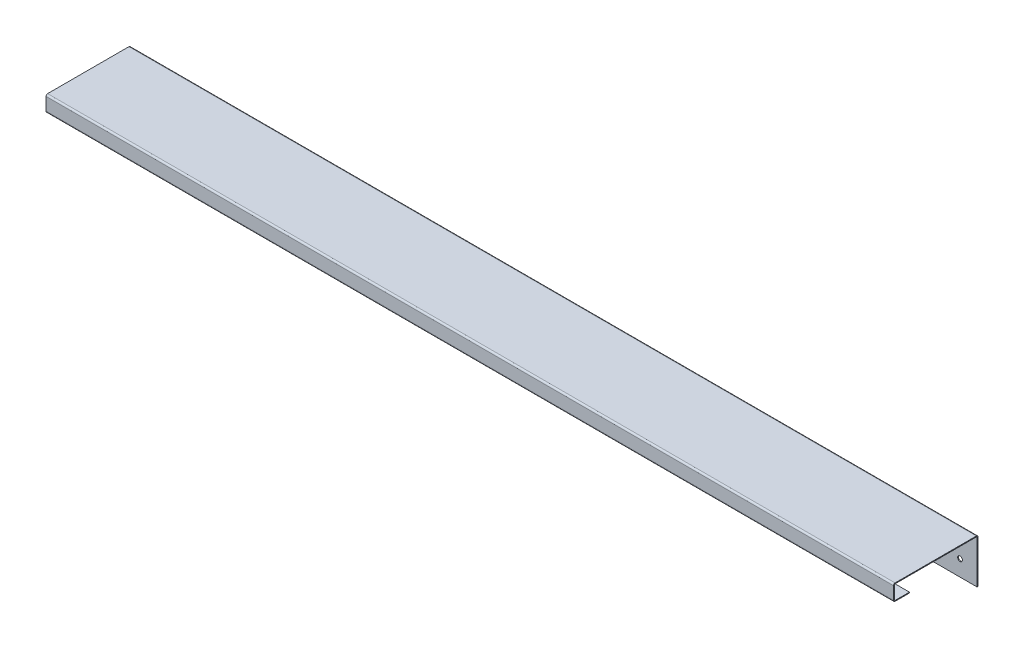
ISO-10303-21;
HEADER;
FILE_DESCRIPTION(('STEP AP214'),'2;1');
FILE_NAME('part.step','',(''),(''),'','','');
FILE_SCHEMA(('AUTOMOTIVE_DESIGN { 1 0 10303 214 1 1 1 1 }'));
ENDSEC;
DATA;
#1=APPLICATION_CONTEXT('core data for automotive mechanical design processes');
#2=APPLICATION_PROTOCOL_DEFINITION('international standard','automotive_design',2000,#1);
#3=PRODUCT_CONTEXT('',#1,'mechanical');
#4=PRODUCT('Part','Part','',(#3));
#5=PRODUCT_RELATED_PRODUCT_CATEGORY('part','',(#4));
#6=PRODUCT_DEFINITION_FORMATION('','',#4);
#7=PRODUCT_DEFINITION_CONTEXT('part definition',#1,'design');
#8=PRODUCT_DEFINITION('design','',#6,#7);
#9=PRODUCT_DEFINITION_SHAPE('','',#8);
#10=(LENGTH_UNIT() NAMED_UNIT(*) SI_UNIT(.MILLI.,.METRE.));
#11=(NAMED_UNIT(*) PLANE_ANGLE_UNIT() SI_UNIT($,.RADIAN.));
#12=(NAMED_UNIT(*) SI_UNIT($,.STERADIAN.) SOLID_ANGLE_UNIT());
#13=UNCERTAINTY_MEASURE_WITH_UNIT(LENGTH_MEASURE(1.E-05),#10,'distance_accuracy_value','');
#14=(GEOMETRIC_REPRESENTATION_CONTEXT(3) GLOBAL_UNCERTAINTY_ASSIGNED_CONTEXT((#13)) GLOBAL_UNIT_ASSIGNED_CONTEXT((#10,
#11,#12)) REPRESENTATION_CONTEXT('',''));
#15=CARTESIAN_POINT('',(0.,0.,0.));
#16=DIRECTION('',(0.,0.,1.));
#17=DIRECTION('',(1.,0.,0.));
#18=AXIS2_PLACEMENT_3D('',#15,#16,#17);
#19=CARTESIAN_POINT('',(1063.,27.7674141676382,-103.));
#20=DIRECTION('',(1.,0.,0.));
#21=DIRECTION('',(0.,0.,-1.));
#22=AXIS2_PLACEMENT_3D('',#19,#20,#21);
#23=PLANE('',#22);
#24=DIRECTION('',(0.,1.,0.));
#25=VECTOR('',#24,1.);
#26=CARTESIAN_POINT('',(1063.,27.7674141676382,-103.));
#27=LINE('',#26,#25);
#28=CARTESIAN_POINT('',(1063.,27.7674141676382,-103.));
#29=VERTEX_POINT('',#28);
#30=CARTESIAN_POINT('',(1063.,28.7674141676382,-103.));
#31=VERTEX_POINT('',#30);
#32=EDGE_CURVE('E11',#29,#31,#27,.T.);
#33=ORIENTED_EDGE('',*,*,#32,.F.);
#34=CARTESIAN_POINT('',(1063.,26.7674141676382,-103.));
#35=DIRECTION('',(-1.,0.,0.));
#36=DIRECTION('',(0.,0.,1.));
#37=AXIS2_PLACEMENT_3D('',#34,#35,#36);
#38=CIRCLE('',#37,1.);
#39=CARTESIAN_POINT('',(1063.,26.7674141676382,-104.));
#40=VERTEX_POINT('',#39);
#41=EDGE_CURVE('E385',#40,#29,#38,.F.);
#42=ORIENTED_EDGE('',*,*,#41,.F.);
#43=DIRECTION('',(0.,0.,1.));
#44=VECTOR('',#43,1.);
#45=CARTESIAN_POINT('',(1063.,26.7674141676382,-105.));
#46=LINE('',#45,#44);
#47=CARTESIAN_POINT('',(1063.,26.7674141676382,-105.));
#48=VERTEX_POINT('',#47);
#49=EDGE_CURVE('E50',#48,#40,#46,.T.);
#50=ORIENTED_EDGE('',*,*,#49,.F.);
#51=CARTESIAN_POINT('',(1063.,26.7674141676382,-103.));
#52=DIRECTION('',(1.,0.,0.));
#53=DIRECTION('',(0.,0.,-1.));
#54=AXIS2_PLACEMENT_3D('',#51,#52,#53);
#55=CIRCLE('',#54,2.);
#56=EDGE_CURVE('E401',#48,#31,#55,.T.);
#57=ORIENTED_EDGE('',*,*,#56,.T.);
#58=EDGE_LOOP('',(#33,#42,#50,#57));
#59=FACE_BOUND('',#58,.T.);
#60=ADVANCED_FACE('F40',(#59),#23,.T.);
#61=CARTESIAN_POINT('',(1063.,26.7674141676382,-105.));
#62=DIRECTION('',(1.,0.,0.));
#63=DIRECTION('',(0.,0.,-1.));
#64=AXIS2_PLACEMENT_3D('',#61,#62,#63);
#65=PLANE('',#64);
#66=DIRECTION('',(0.,0.,1.));
#67=VECTOR('',#66,1.);
#68=CARTESIAN_POINT('',(1063.,27.7674141676382,-104.));
#69=LINE('',#68,#67);
#70=CARTESIAN_POINT('',(1063.,27.7674141676382,-1.));
#71=VERTEX_POINT('',#70);
#72=EDGE_CURVE('E381',#29,#71,#69,.T.);
#73=ORIENTED_EDGE('',*,*,#72,.F.);
#74=ORIENTED_EDGE('',*,*,#32,.T.);
#75=DIRECTION('',(0.,0.,1.));
#76=VECTOR('',#75,1.);
#77=CARTESIAN_POINT('',(1063.,28.7674141676382,-104.));
#78=LINE('',#77,#76);
#79=CARTESIAN_POINT('',(1063.,28.7674141676382,-1.));
#80=VERTEX_POINT('',#79);
#81=EDGE_CURVE('E188',#31,#80,#78,.T.);
#82=ORIENTED_EDGE('',*,*,#81,.T.);
#83=DIRECTION('',(0.,-1.,0.));
#84=VECTOR('',#83,1.);
#85=CARTESIAN_POINT('',(1063.,28.7674141676382,-1.));
#86=LINE('',#85,#84);
#87=EDGE_CURVE('E178',#80,#71,#86,.T.);
#88=ORIENTED_EDGE('',*,*,#87,.T.);
#89=EDGE_LOOP('',(#73,#74,#82,#88));
#90=FACE_BOUND('',#89,.T.);
#91=ADVANCED_FACE('F409',(#90),#65,.T.);
#92=CARTESIAN_POINT('',(0.,26.7674141676382,-104.));
#93=DIRECTION('',(-1.,0.,0.));
#94=DIRECTION('',(0.,0.,1.));
#95=AXIS2_PLACEMENT_3D('',#92,#93,#94);
#96=PLANE('',#95);
#97=DIRECTION('',(0.,0.,-1.));
#98=VECTOR('',#97,1.);
#99=CARTESIAN_POINT('',(0.,26.7674141676382,-104.));
#100=LINE('',#99,#98);
#101=CARTESIAN_POINT('',(0.,26.7674141676382,-104.));
#102=VERTEX_POINT('',#101);
#103=CARTESIAN_POINT('',(0.,26.7674141676382,-105.));
#104=VERTEX_POINT('',#103);
#105=EDGE_CURVE('E340',#102,#104,#100,.T.);
#106=ORIENTED_EDGE('',*,*,#105,.F.);
#107=CARTESIAN_POINT('',(0.,26.7674141676382,-103.));
#108=DIRECTION('',(-1.,0.,0.));
#109=DIRECTION('',(0.,0.,1.));
#110=AXIS2_PLACEMENT_3D('',#107,#108,#109);
#111=CIRCLE('',#110,1.);
#112=CARTESIAN_POINT('',(0.,27.7674141676382,-103.));
#113=VERTEX_POINT('',#112);
#114=EDGE_CURVE('E238',#102,#113,#111,.F.);
#115=ORIENTED_EDGE('',*,*,#114,.T.);
#116=DIRECTION('',(0.,-1.,0.));
#117=VECTOR('',#116,1.);
#118=CARTESIAN_POINT('',(0.,28.7674141676382,-103.));
#119=LINE('',#118,#117);
#120=CARTESIAN_POINT('',(0.,28.7674141676382,-103.));
#121=VERTEX_POINT('',#120);
#122=EDGE_CURVE('E177',#121,#113,#119,.T.);
#123=ORIENTED_EDGE('',*,*,#122,.F.);
#124=CARTESIAN_POINT('',(0.,26.7674141676382,-103.));
#125=DIRECTION('',(1.,0.,0.));
#126=DIRECTION('',(0.,0.,-1.));
#127=AXIS2_PLACEMENT_3D('',#124,#125,#126);
#128=CIRCLE('',#127,2.);
#129=EDGE_CURVE('E254',#104,#121,#128,.T.);
#130=ORIENTED_EDGE('',*,*,#129,.F.);
#131=EDGE_LOOP('',(#106,#115,#123,#130));
#132=FACE_BOUND('',#131,.T.);
#133=ADVANCED_FACE('F458',(#132),#96,.T.);
#134=CARTESIAN_POINT('',(0.,28.7674141676382,-103.));
#135=DIRECTION('',(-1.,0.,0.));
#136=DIRECTION('',(0.,0.,1.));
#137=AXIS2_PLACEMENT_3D('',#134,#135,#136);
#138=PLANE('',#137);
#139=DIRECTION('',(0.,1.,0.));
#140=VECTOR('',#139,1.);
#141=CARTESIAN_POINT('',(0.,-27.2325858323618,-104.));
#142=LINE('',#141,#140);
#143=CARTESIAN_POINT('',(0.,-27.2325858323618,-104.));
#144=VERTEX_POINT('',#143);
#145=EDGE_CURVE('E242',#144,#102,#142,.T.);
#146=ORIENTED_EDGE('',*,*,#145,.T.);
#147=ORIENTED_EDGE('',*,*,#105,.T.);
#148=DIRECTION('',(0.,1.,0.));
#149=VECTOR('',#148,1.);
#150=CARTESIAN_POINT('',(0.,-27.2325858323618,-105.));
#151=LINE('',#150,#149);
#152=CARTESIAN_POINT('',(0.,-27.2325858323618,-105.));
#153=VERTEX_POINT('',#152);
#154=EDGE_CURVE('E250',#153,#104,#151,.T.);
#155=ORIENTED_EDGE('',*,*,#154,.F.);
#156=DIRECTION('',(0.,0.,1.));
#157=VECTOR('',#156,1.);
#158=CARTESIAN_POINT('',(0.,-27.2325858323618,-105.));
#159=LINE('',#158,#157);
#160=EDGE_CURVE('E246',#153,#144,#159,.T.);
#161=ORIENTED_EDGE('',*,*,#160,.T.);
#162=EDGE_LOOP('',(#146,#147,#155,#161));
#163=FACE_BOUND('',#162,.T.);
#164=ADVANCED_FACE('F492',(#163),#138,.T.);
#165=CARTESIAN_POINT('',(1063.,26.7674141676382,0.));
#166=DIRECTION('',(1.,0.,0.));
#167=DIRECTION('',(0.,0.,-1.));
#168=AXIS2_PLACEMENT_3D('',#165,#166,#167);
#169=PLANE('',#168);
#170=DIRECTION('',(0.,0.,1.));
#171=VECTOR('',#170,1.);
#172=CARTESIAN_POINT('',(1063.,26.7674141676382,0.));
#173=LINE('',#172,#171);
#174=CARTESIAN_POINT('',(1063.,26.7674141676382,0.));
#175=VERTEX_POINT('',#174);
#176=CARTESIAN_POINT('',(1063.,26.7674141676382,1.));
#177=VERTEX_POINT('',#176);
#178=EDGE_CURVE('E164',#175,#177,#173,.T.);
#179=ORIENTED_EDGE('',*,*,#178,.F.);
#180=CARTESIAN_POINT('',(1063.,26.7674141676382,-1.));
#181=DIRECTION('',(-1.,0.,0.));
#182=DIRECTION('',(0.,0.,1.));
#183=AXIS2_PLACEMENT_3D('',#180,#181,#182);
#184=CIRCLE('',#183,1.);
#185=EDGE_CURVE('E378',#71,#175,#184,.F.);
#186=ORIENTED_EDGE('',*,*,#185,.F.);
#187=ORIENTED_EDGE('',*,*,#87,.F.);
#188=CARTESIAN_POINT('',(1063.,26.7674141676382,-1.));
#189=DIRECTION('',(1.,0.,0.));
#190=DIRECTION('',(0.,0.,-1.));
#191=AXIS2_PLACEMENT_3D('',#188,#189,#190);
#192=CIRCLE('',#191,2.);
#193=EDGE_CURVE('E181',#80,#177,#192,.T.);
#194=ORIENTED_EDGE('',*,*,#193,.T.);
#195=EDGE_LOOP('',(#179,#186,#187,#194));
#196=FACE_BOUND('',#195,.T.);
#197=ADVANCED_FACE('F183',(#196),#169,.T.);
#198=CARTESIAN_POINT('',(1063.,28.7674141676382,-1.));
#199=DIRECTION('',(1.,0.,0.));
#200=DIRECTION('',(0.,0.,-1.));
#201=AXIS2_PLACEMENT_3D('',#198,#199,#200);
#202=PLANE('',#201);
#203=DIRECTION('',(0.,-1.,0.));
#204=VECTOR('',#203,1.);
#205=CARTESIAN_POINT('',(1063.,27.7674141676382,0.));
#206=LINE('',#205,#204);
#207=CARTESIAN_POINT('',(1063.,10.7674141676382,0.));
#208=VERTEX_POINT('',#207);
#209=EDGE_CURVE('E171',#175,#208,#206,.T.);
#210=ORIENTED_EDGE('',*,*,#209,.F.);
#211=ORIENTED_EDGE('',*,*,#178,.T.);
#212=DIRECTION('',(0.,-1.,0.));
#213=VECTOR('',#212,1.);
#214=CARTESIAN_POINT('',(1063.,27.7674141676382,1.));
#215=LINE('',#214,#213);
#216=CARTESIAN_POINT('',(1063.,10.7674141676382,0.999999999999998));
#217=VERTEX_POINT('',#216);
#218=EDGE_CURVE('E168',#177,#217,#215,.T.);
#219=ORIENTED_EDGE('',*,*,#218,.T.);
#220=DIRECTION('',(0.,0.,-1.));
#221=VECTOR('',#220,1.);
#222=CARTESIAN_POINT('',(1063.,10.7674141676382,0.999999999999998));
#223=LINE('',#222,#221);
#224=EDGE_CURVE('E325',#217,#208,#223,.T.);
#225=ORIENTED_EDGE('',*,*,#224,.T.);
#226=EDGE_LOOP('',(#210,#211,#219,#225));
#227=FACE_BOUND('',#226,.T.);
#228=ADVANCED_FACE('F166',(#227),#202,.T.);
#229=CARTESIAN_POINT('',(0.,27.7674141676382,-1.));
#230=DIRECTION('',(-1.,0.,0.));
#231=DIRECTION('',(0.,0.,1.));
#232=AXIS2_PLACEMENT_3D('',#229,#230,#231);
#233=PLANE('',#232);
#234=DIRECTION('',(0.,1.,0.));
#235=VECTOR('',#234,1.);
#236=CARTESIAN_POINT('',(0.,27.7674141676382,-1.));
#237=LINE('',#236,#235);
#238=CARTESIAN_POINT('',(0.,27.7674141676382,-1.));
#239=VERTEX_POINT('',#238);
#240=CARTESIAN_POINT('',(0.,28.7674141676382,-1.));
#241=VERTEX_POINT('',#240);
#242=EDGE_CURVE('E333',#239,#241,#237,.T.);
#243=ORIENTED_EDGE('',*,*,#242,.F.);
#244=CARTESIAN_POINT('',(0.,26.7674141676382,-1.));
#245=DIRECTION('',(-1.,0.,0.));
#246=DIRECTION('',(0.,0.,1.));
#247=AXIS2_PLACEMENT_3D('',#244,#245,#246);
#248=CIRCLE('',#247,1.);
#249=CARTESIAN_POINT('',(0.,26.7674141676382,0.));
#250=VERTEX_POINT('',#249);
#251=EDGE_CURVE('E230',#239,#250,#248,.F.);
#252=ORIENTED_EDGE('',*,*,#251,.T.);
#253=DIRECTION('',(0.,0.,-1.));
#254=VECTOR('',#253,1.);
#255=CARTESIAN_POINT('',(0.,26.7674141676382,1.));
#256=LINE('',#255,#254);
#257=CARTESIAN_POINT('',(0.,26.7674141676382,1.));
#258=VERTEX_POINT('',#257);
#259=EDGE_CURVE('E330',#258,#250,#256,.T.);
#260=ORIENTED_EDGE('',*,*,#259,.F.);
#261=CARTESIAN_POINT('',(0.,26.7674141676382,-1.));
#262=DIRECTION('',(1.,0.,0.));
#263=DIRECTION('',(0.,0.,-1.));
#264=AXIS2_PLACEMENT_3D('',#261,#262,#263);
#265=CIRCLE('',#264,2.);
#266=EDGE_CURVE('E195',#241,#258,#265,.T.);
#267=ORIENTED_EDGE('',*,*,#266,.F.);
#268=EDGE_LOOP('',(#243,#252,#260,#267));
#269=FACE_BOUND('',#268,.T.);
#270=ADVANCED_FACE('F415',(#269),#233,.T.);
#271=CARTESIAN_POINT('',(0.,26.7674141676382,1.));
#272=DIRECTION('',(-1.,0.,0.));
#273=DIRECTION('',(0.,0.,1.));
#274=AXIS2_PLACEMENT_3D('',#271,#272,#273);
#275=PLANE('',#274);
#276=DIRECTION('',(0.,0.,1.));
#277=VECTOR('',#276,1.);
#278=CARTESIAN_POINT('',(0.,27.7674141676382,-104.));
#279=LINE('',#278,#277);
#280=EDGE_CURVE('E234',#113,#239,#279,.T.);
#281=ORIENTED_EDGE('',*,*,#280,.T.);
#282=ORIENTED_EDGE('',*,*,#242,.T.);
#283=DIRECTION('',(0.,0.,1.));
#284=VECTOR('',#283,1.);
#285=CARTESIAN_POINT('',(0.,28.7674141676382,-104.));
#286=LINE('',#285,#284);
#287=EDGE_CURVE('E258',#121,#241,#286,.T.);
#288=ORIENTED_EDGE('',*,*,#287,.F.);
#289=ORIENTED_EDGE('',*,*,#122,.T.);
#290=EDGE_LOOP('',(#281,#282,#288,#289));
#291=FACE_BOUND('',#290,.T.);
#292=ADVANCED_FACE('F489',(#291),#275,.T.);
#293=CARTESIAN_POINT('',(1063.,9.76741416763816,-1.));
#294=DIRECTION('',(1.,0.,0.));
#295=DIRECTION('',(0.,0.,-1.));
#296=AXIS2_PLACEMENT_3D('',#293,#294,#295);
#297=PLANE('',#296);
#298=DIRECTION('',(0.,-1.,0.));
#299=VECTOR('',#298,1.);
#300=CARTESIAN_POINT('',(1063.,9.76741416763816,-1.));
#301=LINE('',#300,#299);
#302=CARTESIAN_POINT('',(1063.,9.76741416763816,-1.));
#303=VERTEX_POINT('',#302);
#304=CARTESIAN_POINT('',(1063.,8.76741416763816,-1.));
#305=VERTEX_POINT('',#304);
#306=EDGE_CURVE('E59',#303,#305,#301,.T.);
#307=ORIENTED_EDGE('',*,*,#306,.F.);
#308=CARTESIAN_POINT('',(1063.,10.7674141676382,-1.));
#309=DIRECTION('',(-1.,0.,0.));
#310=DIRECTION('',(0.,0.,1.));
#311=AXIS2_PLACEMENT_3D('',#308,#309,#310);
#312=CIRCLE('',#311,1.);
#313=EDGE_CURVE('E372',#208,#303,#312,.F.);
#314=ORIENTED_EDGE('',*,*,#313,.F.);
#315=ORIENTED_EDGE('',*,*,#224,.F.);
#316=CARTESIAN_POINT('',(1063.,10.7674141676382,-1.));
#317=DIRECTION('',(1.,0.,0.));
#318=DIRECTION('',(0.,0.,-1.));
#319=AXIS2_PLACEMENT_3D('',#316,#317,#318);
#320=CIRCLE('',#319,2.);
#321=EDGE_CURVE('E205',#217,#305,#320,.T.);
#322=ORIENTED_EDGE('',*,*,#321,.T.);
#323=EDGE_LOOP('',(#307,#314,#315,#322));
#324=FACE_BOUND('',#323,.T.);
#325=ADVANCED_FACE('F508',(#324),#297,.T.);
#326=CARTESIAN_POINT('',(1063.,10.7674141676382,0.999999999999998));
#327=DIRECTION('',(1.,0.,0.));
#328=DIRECTION('',(0.,0.,-1.));
#329=AXIS2_PLACEMENT_3D('',#326,#327,#328);
#330=PLANE('',#329);
#331=DIRECTION('',(0.,0.,-1.));
#332=VECTOR('',#331,1.);
#333=CARTESIAN_POINT('',(1063.,9.76741416763816,0.));
#334=LINE('',#333,#332);
#335=CARTESIAN_POINT('',(1063.,9.76741416763816,-19.));
#336=VERTEX_POINT('',#335);
#337=EDGE_CURVE('E368',#303,#336,#334,.T.);
#338=ORIENTED_EDGE('',*,*,#337,.F.);
#339=ORIENTED_EDGE('',*,*,#306,.T.);
#340=DIRECTION('',(0.,0.,-1.));
#341=VECTOR('',#340,1.);
#342=CARTESIAN_POINT('',(1063.,8.76741416763816,0.));
#343=LINE('',#342,#341);
#344=CARTESIAN_POINT('',(1063.,8.76741416763816,-19.));
#345=VERTEX_POINT('',#344);
#346=EDGE_CURVE('E125',#305,#345,#343,.T.);
#347=ORIENTED_EDGE('',*,*,#346,.T.);
#348=DIRECTION('',(0.,-1.,0.));
#349=VECTOR('',#348,1.);
#350=CARTESIAN_POINT('',(1063.,9.76741416763816,-19.));
#351=LINE('',#350,#349);
#352=EDGE_CURVE('E364',#336,#345,#351,.T.);
#353=ORIENTED_EDGE('',*,*,#352,.F.);
#354=EDGE_LOOP('',(#338,#339,#347,#353));
#355=FACE_BOUND('',#354,.T.);
#356=ADVANCED_FACE('F442',(#355),#330,.T.);
#357=CARTESIAN_POINT('',(0.,10.7674141676382,0.));
#358=DIRECTION('',(-1.,0.,0.));
#359=DIRECTION('',(0.,0.,1.));
#360=AXIS2_PLACEMENT_3D('',#357,#358,#359);
#361=PLANE('',#360);
#362=DIRECTION('',(0.,0.,1.));
#363=VECTOR('',#362,1.);
#364=CARTESIAN_POINT('',(0.,10.7674141676382,0.));
#365=LINE('',#364,#363);
#366=CARTESIAN_POINT('',(0.,10.7674141676382,0.));
#367=VERTEX_POINT('',#366);
#368=CARTESIAN_POINT('',(0.,10.7674141676382,0.999999999999998));
#369=VERTEX_POINT('',#368);
#370=EDGE_CURVE('E112',#367,#369,#365,.T.);
#371=ORIENTED_EDGE('',*,*,#370,.F.);
#372=CARTESIAN_POINT('',(0.,10.7674141676382,-1.));
#373=DIRECTION('',(-1.,0.,0.));
#374=DIRECTION('',(0.,0.,1.));
#375=AXIS2_PLACEMENT_3D('',#372,#373,#374);
#376=CIRCLE('',#375,1.);
#377=CARTESIAN_POINT('',(0.,9.76741416763816,-1.));
#378=VERTEX_POINT('',#377);
#379=EDGE_CURVE('E224',#367,#378,#376,.F.);
#380=ORIENTED_EDGE('',*,*,#379,.T.);
#381=DIRECTION('',(0.,1.,0.));
#382=VECTOR('',#381,1.);
#383=CARTESIAN_POINT('',(0.,8.76741416763816,-1.));
#384=LINE('',#383,#382);
#385=CARTESIAN_POINT('',(0.,8.76741416763816,-1.));
#386=VERTEX_POINT('',#385);
#387=EDGE_CURVE('E119',#386,#378,#384,.T.);
#388=ORIENTED_EDGE('',*,*,#387,.F.);
#389=CARTESIAN_POINT('',(0.,10.7674141676382,-1.));
#390=DIRECTION('',(1.,0.,0.));
#391=DIRECTION('',(0.,0.,-1.));
#392=AXIS2_PLACEMENT_3D('',#389,#390,#391);
#393=CIRCLE('',#392,2.);
#394=EDGE_CURVE('E267',#369,#386,#393,.T.);
#395=ORIENTED_EDGE('',*,*,#394,.F.);
#396=EDGE_LOOP('',(#371,#380,#388,#395));
#397=FACE_BOUND('',#396,.T.);
#398=ADVANCED_FACE('F430',(#397),#361,.T.);
#399=CARTESIAN_POINT('',(0.,8.76741416763816,-1.));
#400=DIRECTION('',(-1.,0.,0.));
#401=DIRECTION('',(0.,0.,1.));
#402=AXIS2_PLACEMENT_3D('',#399,#400,#401);
#403=PLANE('',#402);
#404=DIRECTION('',(0.,-1.,0.));
#405=VECTOR('',#404,1.);
#406=CARTESIAN_POINT('',(0.,27.7674141676382,0.));
#407=LINE('',#406,#405);
#408=EDGE_CURVE('E227',#250,#367,#407,.T.);
#409=ORIENTED_EDGE('',*,*,#408,.T.);
#410=ORIENTED_EDGE('',*,*,#370,.T.);
#411=DIRECTION('',(0.,-1.,0.));
#412=VECTOR('',#411,1.);
#413=CARTESIAN_POINT('',(0.,27.7674141676382,1.));
#414=LINE('',#413,#412);
#415=EDGE_CURVE('E264',#258,#369,#414,.T.);
#416=ORIENTED_EDGE('',*,*,#415,.F.);
#417=ORIENTED_EDGE('',*,*,#259,.T.);
#418=EDGE_LOOP('',(#409,#410,#416,#417));
#419=FACE_BOUND('',#418,.T.);
#420=ADVANCED_FACE('F417',(#419),#403,.T.);
#421=CARTESIAN_POINT('',(1063.,8.76741416763816,0.));
#422=DIRECTION('',(0.,1.,0.));
#423=DIRECTION('',(0.,0.,1.));
#424=AXIS2_PLACEMENT_3D('',#421,#422,#423);
#425=PLANE('',#424);
#426=DIRECTION('',(0.,0.,-1.));
#427=VECTOR('',#426,1.);
#428=CARTESIAN_POINT('',(0.,8.76741416763816,0.));
#429=LINE('',#428,#427);
#430=CARTESIAN_POINT('',(0.,8.76741416763816,-19.));
#431=VERTEX_POINT('',#430);
#432=EDGE_CURVE('E212',#386,#431,#429,.T.);
#433=ORIENTED_EDGE('',*,*,#432,.T.);
#434=DIRECTION('',(-1.,0.,0.));
#435=VECTOR('',#434,1.);
#436=CARTESIAN_POINT('',(1063.,8.76741416763816,-19.));
#437=LINE('',#436,#435);
#438=EDGE_CURVE('E318',#345,#431,#437,.T.);
#439=ORIENTED_EDGE('',*,*,#438,.F.);
#440=ORIENTED_EDGE('',*,*,#346,.F.);
#441=DIRECTION('',(-1.,0.,0.));
#442=VECTOR('',#441,1.);
#443=CARTESIAN_POINT('',(1063.,8.76741416763816,-1.));
#444=LINE('',#443,#442);
#445=EDGE_CURVE('E208',#305,#386,#444,.T.);
#446=ORIENTED_EDGE('',*,*,#445,.T.);
#447=EDGE_LOOP('',(#433,#439,#440,#446));
#448=FACE_BOUND('',#447,.T.);
#449=ADVANCED_FACE('F436',(#448),#425,.F.);
#450=CARTESIAN_POINT('',(1063.,9.76741416763816,-19.));
#451=DIRECTION('',(0.,0.,-1.));
#452=DIRECTION('',(-1.,0.,0.));
#453=AXIS2_PLACEMENT_3D('',#450,#451,#452);
#454=PLANE('',#453);
#455=DIRECTION('',(0.,-1.,0.));
#456=VECTOR('',#455,1.);
#457=CARTESIAN_POINT('',(0.,9.76741416763816,-19.));
#458=LINE('',#457,#456);
#459=CARTESIAN_POINT('',(0.,9.76741416763816,-19.));
#460=VERTEX_POINT('',#459);
#461=EDGE_CURVE('E216',#460,#431,#458,.T.);
#462=ORIENTED_EDGE('',*,*,#461,.F.);
#463=DIRECTION('',(-1.,0.,0.));
#464=VECTOR('',#463,1.);
#465=CARTESIAN_POINT('',(1063.,9.76741416763816,-19.));
#466=LINE('',#465,#464);
#467=EDGE_CURVE('E315',#336,#460,#466,.T.);
#468=ORIENTED_EDGE('',*,*,#467,.F.);
#469=ORIENTED_EDGE('',*,*,#352,.T.);
#470=ORIENTED_EDGE('',*,*,#438,.T.);
#471=EDGE_LOOP('',(#462,#468,#469,#470));
#472=FACE_BOUND('',#471,.T.);
#473=ADVANCED_FACE('F441',(#472),#454,.T.);
#474=CARTESIAN_POINT('',(1063.,9.76741416763816,0.));
#475=DIRECTION('',(0.,1.,0.));
#476=DIRECTION('',(0.,0.,1.));
#477=AXIS2_PLACEMENT_3D('',#474,#475,#476);
#478=PLANE('',#477);
#479=DIRECTION('',(0.,0.,-1.));
#480=VECTOR('',#479,1.);
#481=CARTESIAN_POINT('',(0.,9.76741416763816,0.));
#482=LINE('',#481,#480);
#483=EDGE_CURVE('E220',#378,#460,#482,.T.);
#484=ORIENTED_EDGE('',*,*,#483,.F.);
#485=DIRECTION('',(-1.,0.,0.));
#486=VECTOR('',#485,1.);
#487=CARTESIAN_POINT('',(1063.,9.76741416763816,-1.));
#488=LINE('',#487,#486);
#489=EDGE_CURVE('E311',#303,#378,#488,.T.);
#490=ORIENTED_EDGE('',*,*,#489,.F.);
#491=ORIENTED_EDGE('',*,*,#337,.T.);
#492=ORIENTED_EDGE('',*,*,#467,.T.);
#493=EDGE_LOOP('',(#484,#490,#491,#492));
#494=FACE_BOUND('',#493,.T.);
#495=ADVANCED_FACE('F444',(#494),#478,.T.);
#496=CARTESIAN_POINT('',(1063.,10.7674141676382,-1.));
#497=DIRECTION('',(-1.,0.,0.));
#498=DIRECTION('',(0.,0.,1.));
#499=AXIS2_PLACEMENT_3D('',#496,#497,#498);
#500=CYLINDRICAL_SURFACE('',#499,1.);
#501=ORIENTED_EDGE('',*,*,#379,.F.);
#502=DIRECTION('',(-1.,0.,0.));
#503=VECTOR('',#502,1.);
#504=CARTESIAN_POINT('',(1063.,10.7674141676382,0.));
#505=LINE('',#504,#503);
#506=EDGE_CURVE('E307',#208,#367,#505,.T.);
#507=ORIENTED_EDGE('',*,*,#506,.F.);
#508=ORIENTED_EDGE('',*,*,#313,.T.);
#509=ORIENTED_EDGE('',*,*,#489,.T.);
#510=EDGE_LOOP('',(#501,#507,#508,#509));
#511=FACE_BOUND('',#510,.T.);
#512=ADVANCED_FACE('F427',(#511),#500,.F.);
#513=CARTESIAN_POINT('',(1063.,27.7674141676382,0.));
#514=DIRECTION('',(0.,0.,-1.));
#515=DIRECTION('',(0.,1.,0.));
#516=AXIS2_PLACEMENT_3D('',#513,#514,#515);
#517=PLANE('',#516);
#518=ORIENTED_EDGE('',*,*,#408,.F.);
#519=DIRECTION('',(-1.,0.,0.));
#520=VECTOR('',#519,1.);
#521=CARTESIAN_POINT('',(1063.,26.7674141676382,0.));
#522=LINE('',#521,#520);
#523=EDGE_CURVE('E303',#175,#250,#522,.T.);
#524=ORIENTED_EDGE('',*,*,#523,.F.);
#525=ORIENTED_EDGE('',*,*,#209,.T.);
#526=ORIENTED_EDGE('',*,*,#506,.T.);
#527=EDGE_LOOP('',(#518,#524,#525,#526));
#528=FACE_BOUND('',#527,.T.);
#529=ADVANCED_FACE('F422',(#528),#517,.T.);
#530=CARTESIAN_POINT('',(1063.,26.7674141676382,-1.));
#531=DIRECTION('',(-1.,0.,0.));
#532=DIRECTION('',(0.,0.,1.));
#533=AXIS2_PLACEMENT_3D('',#530,#531,#532);
#534=CYLINDRICAL_SURFACE('',#533,1.);
#535=ORIENTED_EDGE('',*,*,#251,.F.);
#536=DIRECTION('',(-1.,0.,0.));
#537=VECTOR('',#536,1.);
#538=CARTESIAN_POINT('',(1063.,27.7674141676382,-1.));
#539=LINE('',#538,#537);
#540=EDGE_CURVE('E299',#71,#239,#539,.T.);
#541=ORIENTED_EDGE('',*,*,#540,.F.);
#542=ORIENTED_EDGE('',*,*,#185,.T.);
#543=ORIENTED_EDGE('',*,*,#523,.T.);
#544=EDGE_LOOP('',(#535,#541,#542,#543));
#545=FACE_BOUND('',#544,.T.);
#546=ADVANCED_FACE('F420',(#545),#534,.F.);
#547=CARTESIAN_POINT('',(1063.,27.7674141676382,-104.));
#548=DIRECTION('',(0.,-1.,0.));
#549=DIRECTION('',(0.,0.,-1.));
#550=AXIS2_PLACEMENT_3D('',#547,#548,#549);
#551=PLANE('',#550);
#552=ORIENTED_EDGE('',*,*,#280,.F.);
#553=DIRECTION('',(-1.,0.,0.));
#554=VECTOR('',#553,1.);
#555=CARTESIAN_POINT('',(1063.,27.7674141676382,-103.));
#556=LINE('',#555,#554);
#557=EDGE_CURVE('E295',#29,#113,#556,.T.);
#558=ORIENTED_EDGE('',*,*,#557,.F.);
#559=ORIENTED_EDGE('',*,*,#72,.T.);
#560=ORIENTED_EDGE('',*,*,#540,.T.);
#561=EDGE_LOOP('',(#552,#558,#559,#560));
#562=FACE_BOUND('',#561,.T.);
#563=ADVANCED_FACE('F465',(#562),#551,.T.);
#564=CARTESIAN_POINT('',(1063.,26.7674141676382,-103.));
#565=DIRECTION('',(-1.,0.,0.));
#566=DIRECTION('',(0.,0.,1.));
#567=AXIS2_PLACEMENT_3D('',#564,#565,#566);
#568=CYLINDRICAL_SURFACE('',#567,1.);
#569=ORIENTED_EDGE('',*,*,#114,.F.);
#570=DIRECTION('',(-1.,0.,0.));
#571=VECTOR('',#570,1.);
#572=CARTESIAN_POINT('',(1063.,26.7674141676382,-104.));
#573=LINE('',#572,#571);
#574=EDGE_CURVE('E291',#40,#102,#573,.T.);
#575=ORIENTED_EDGE('',*,*,#574,.F.);
#576=ORIENTED_EDGE('',*,*,#41,.T.);
#577=ORIENTED_EDGE('',*,*,#557,.T.);
#578=EDGE_LOOP('',(#569,#575,#576,#577));
#579=FACE_BOUND('',#578,.T.);
#580=ADVANCED_FACE('F469',(#579),#568,.F.);
#581=CARTESIAN_POINT('',(1063.,-27.2325858323618,-104.));
#582=DIRECTION('',(0.,0.,1.));
#583=DIRECTION('',(1.,0.,0.));
#584=AXIS2_PLACEMENT_3D('',#581,#582,#583);
#585=PLANE('',#584);
#586=CARTESIAN_POINT('',(21.5,-7.23258583236184,-104.));
#587=DIRECTION('',(0.,0.,1.));
#588=DIRECTION('',(1.,0.,0.));
#589=AXIS2_PLACEMENT_3D('',#586,#587,#588);
#590=CIRCLE('',#589,3.00000000000001);
#591=CARTESIAN_POINT('',(24.5,-7.23258583236184,-104.));
#592=VERTEX_POINT('',#591);
#593=EDGE_CURVE('E347',#592,#592,#590,.T.);
#594=ORIENTED_EDGE('',*,*,#593,.F.);
#595=EDGE_LOOP('',(#594));
#596=FACE_BOUND('',#595,.T.);
#597=CARTESIAN_POINT('',(1041.5,-7.23258583236171,-104.));
#598=DIRECTION('',(0.,0.,1.));
#599=DIRECTION('',(-1.,0.,0.));
#600=AXIS2_PLACEMENT_3D('',#597,#598,#599);
#601=CIRCLE('',#600,2.99999999999993);
#602=CARTESIAN_POINT('',(1038.5,-7.23258583236171,-104.));
#603=VERTEX_POINT('',#602);
#604=EDGE_CURVE('E354',#603,#603,#601,.T.);
#605=ORIENTED_EDGE('',*,*,#604,.F.);
#606=EDGE_LOOP('',(#605));
#607=FACE_BOUND('',#606,.T.);
#608=ORIENTED_EDGE('',*,*,#145,.F.);
#609=DIRECTION('',(-1.,0.,0.));
#610=VECTOR('',#609,1.);
#611=CARTESIAN_POINT('',(1063.,-27.2325858323618,-104.));
#612=LINE('',#611,#610);
#613=CARTESIAN_POINT('',(1063.,-27.2325858323618,-104.));
#614=VERTEX_POINT('',#613);
#615=EDGE_CURVE('E288',#614,#144,#612,.T.);
#616=ORIENTED_EDGE('',*,*,#615,.F.);
#617=DIRECTION('',(0.,1.,0.));
#618=VECTOR('',#617,1.);
#619=CARTESIAN_POINT('',(1063.,-27.2325858323618,-104.));
#620=LINE('',#619,#618);
#621=EDGE_CURVE('E389',#614,#40,#620,.T.);
#622=ORIENTED_EDGE('',*,*,#621,.T.);
#623=ORIENTED_EDGE('',*,*,#574,.T.);
#624=EDGE_LOOP('',(#608,#616,#622,#623));
#625=FACE_BOUND('',#624,.T.);
#626=ADVANCED_FACE('F472',(#596,#607,#625),#585,.T.);
#627=CARTESIAN_POINT('',(1063.,-27.2325858323618,-105.));
#628=DIRECTION('',(0.,-1.,0.));
#629=DIRECTION('',(0.,0.,-1.));
#630=AXIS2_PLACEMENT_3D('',#627,#628,#629);
#631=PLANE('',#630);
#632=ORIENTED_EDGE('',*,*,#160,.F.);
#633=DIRECTION('',(-1.,0.,0.));
#634=VECTOR('',#633,1.);
#635=CARTESIAN_POINT('',(1063.,-27.2325858323618,-105.));
#636=LINE('',#635,#634);
#637=CARTESIAN_POINT('',(1063.,-27.2325858323618,-105.));
#638=VERTEX_POINT('',#637);
#639=EDGE_CURVE('E285',#638,#153,#636,.T.);
#640=ORIENTED_EDGE('',*,*,#639,.F.);
#641=DIRECTION('',(0.,0.,1.));
#642=VECTOR('',#641,1.);
#643=CARTESIAN_POINT('',(1063.,-27.2325858323618,-105.));
#644=LINE('',#643,#642);
#645=EDGE_CURVE('E393',#638,#614,#644,.T.);
#646=ORIENTED_EDGE('',*,*,#645,.T.);
#647=ORIENTED_EDGE('',*,*,#615,.T.);
#648=EDGE_LOOP('',(#632,#640,#646,#647));
#649=FACE_BOUND('',#648,.T.);
#650=ADVANCED_FACE('F479',(#649),#631,.T.);
#651=CARTESIAN_POINT('',(1063.,-27.2325858323618,-105.));
#652=DIRECTION('',(0.,0.,1.));
#653=DIRECTION('',(1.,0.,0.));
#654=AXIS2_PLACEMENT_3D('',#651,#652,#653);
#655=PLANE('',#654);
#656=CARTESIAN_POINT('',(21.5,-7.23258583236184,-105.));
#657=DIRECTION('',(0.,0.,1.));
#658=DIRECTION('',(1.,0.,0.));
#659=AXIS2_PLACEMENT_3D('',#656,#657,#658);
#660=CIRCLE('',#659,3.00000000000001);
#661=CARTESIAN_POINT('',(24.5,-7.23258583236184,-105.));
#662=VERTEX_POINT('',#661);
#663=EDGE_CURVE('E43',#662,#662,#660,.T.);
#664=ORIENTED_EDGE('',*,*,#663,.T.);
#665=EDGE_LOOP('',(#664));
#666=FACE_BOUND('',#665,.T.);
#667=CARTESIAN_POINT('',(1041.5,-7.23258583236171,-105.));
#668=DIRECTION('',(0.,0.,1.));
#669=DIRECTION('',(1.,0.,0.));
#670=AXIS2_PLACEMENT_3D('',#667,#668,#669);
#671=CIRCLE('',#670,2.99999999999993);
#672=CARTESIAN_POINT('',(1044.5,-7.23258583236171,-105.));
#673=VERTEX_POINT('',#672);
#674=EDGE_CURVE('E344',#673,#673,#671,.T.);
#675=ORIENTED_EDGE('',*,*,#674,.T.);
#676=EDGE_LOOP('',(#675));
#677=FACE_BOUND('',#676,.T.);
#678=ORIENTED_EDGE('',*,*,#154,.T.);
#679=DIRECTION('',(-1.,0.,0.));
#680=VECTOR('',#679,1.);
#681=CARTESIAN_POINT('',(1063.,26.7674141676382,-105.));
#682=LINE('',#681,#680);
#683=EDGE_CURVE('E281',#48,#104,#682,.T.);
#684=ORIENTED_EDGE('',*,*,#683,.F.);
#685=DIRECTION('',(0.,1.,0.));
#686=VECTOR('',#685,1.);
#687=CARTESIAN_POINT('',(1063.,-27.2325858323618,-105.));
#688=LINE('',#687,#686);
#689=EDGE_CURVE('E397',#638,#48,#688,.T.);
#690=ORIENTED_EDGE('',*,*,#689,.F.);
#691=ORIENTED_EDGE('',*,*,#639,.T.);
#692=EDGE_LOOP('',(#678,#684,#690,#691));
#693=FACE_BOUND('',#692,.T.);
#694=ADVANCED_FACE('F484',(#666,#677,#693),#655,.F.);
#695=CARTESIAN_POINT('',(1063.,26.7674141676382,-103.));
#696=DIRECTION('',(-1.,0.,0.));
#697=DIRECTION('',(0.,0.,1.));
#698=AXIS2_PLACEMENT_3D('',#695,#696,#697);
#699=CYLINDRICAL_SURFACE('',#698,2.);
#700=ORIENTED_EDGE('',*,*,#129,.T.);
#701=DIRECTION('',(-1.,0.,0.));
#702=VECTOR('',#701,1.);
#703=CARTESIAN_POINT('',(1063.,28.7674141676382,-103.));
#704=LINE('',#703,#702);
#705=EDGE_CURVE('E277',#31,#121,#704,.T.);
#706=ORIENTED_EDGE('',*,*,#705,.F.);
#707=ORIENTED_EDGE('',*,*,#56,.F.);
#708=ORIENTED_EDGE('',*,*,#683,.T.);
#709=EDGE_LOOP('',(#700,#706,#707,#708));
#710=FACE_BOUND('',#709,.T.);
#711=ADVANCED_FACE('F487',(#710),#699,.T.);
#712=CARTESIAN_POINT('',(1063.,28.7674141676382,-104.));
#713=DIRECTION('',(0.,-1.,0.));
#714=DIRECTION('',(0.,0.,-1.));
#715=AXIS2_PLACEMENT_3D('',#712,#713,#714);
#716=PLANE('',#715);
#717=ORIENTED_EDGE('',*,*,#287,.T.);
#718=DIRECTION('',(-1.,0.,0.));
#719=VECTOR('',#718,1.);
#720=CARTESIAN_POINT('',(1063.,28.7674141676382,-1.));
#721=LINE('',#720,#719);
#722=EDGE_CURVE('E198',#80,#241,#721,.T.);
#723=ORIENTED_EDGE('',*,*,#722,.F.);
#724=ORIENTED_EDGE('',*,*,#81,.F.);
#725=ORIENTED_EDGE('',*,*,#705,.T.);
#726=EDGE_LOOP('',(#717,#723,#724,#725));
#727=FACE_BOUND('',#726,.T.);
#728=ADVANCED_FACE('F412',(#727),#716,.F.);
#729=CARTESIAN_POINT('',(1063.,26.7674141676382,-1.));
#730=DIRECTION('',(-1.,0.,0.));
#731=DIRECTION('',(0.,0.,1.));
#732=AXIS2_PLACEMENT_3D('',#729,#730,#731);
#733=CYLINDRICAL_SURFACE('',#732,2.);
#734=ORIENTED_EDGE('',*,*,#266,.T.);
#735=DIRECTION('',(-1.,0.,0.));
#736=VECTOR('',#735,1.);
#737=CARTESIAN_POINT('',(1063.,26.7674141676382,1.));
#738=LINE('',#737,#736);
#739=EDGE_CURVE('E192',#177,#258,#738,.T.);
#740=ORIENTED_EDGE('',*,*,#739,.F.);
#741=ORIENTED_EDGE('',*,*,#193,.F.);
#742=ORIENTED_EDGE('',*,*,#722,.T.);
#743=EDGE_LOOP('',(#734,#740,#741,#742));
#744=FACE_BOUND('',#743,.T.);
#745=ADVANCED_FACE('F193',(#744),#733,.T.);
#746=CARTESIAN_POINT('',(1063.,27.7674141676382,1.));
#747=DIRECTION('',(0.,0.,-1.));
#748=DIRECTION('',(0.,1.,0.));
#749=AXIS2_PLACEMENT_3D('',#746,#747,#748);
#750=PLANE('',#749);
#751=ORIENTED_EDGE('',*,*,#415,.T.);
#752=DIRECTION('',(-1.,0.,0.));
#753=VECTOR('',#752,1.);
#754=CARTESIAN_POINT('',(1063.,10.7674141676382,0.999999999999998));
#755=LINE('',#754,#753);
#756=EDGE_CURVE('E199',#217,#369,#755,.T.);
#757=ORIENTED_EDGE('',*,*,#756,.F.);
#758=ORIENTED_EDGE('',*,*,#218,.F.);
#759=ORIENTED_EDGE('',*,*,#739,.T.);
#760=EDGE_LOOP('',(#751,#757,#758,#759));
#761=FACE_BOUND('',#760,.T.);
#762=ADVANCED_FACE('F201',(#761),#750,.F.);
#763=CARTESIAN_POINT('',(1063.,10.7674141676382,-1.));
#764=DIRECTION('',(-1.,0.,0.));
#765=DIRECTION('',(0.,0.,1.));
#766=AXIS2_PLACEMENT_3D('',#763,#764,#765);
#767=CYLINDRICAL_SURFACE('',#766,2.);
#768=ORIENTED_EDGE('',*,*,#394,.T.);
#769=ORIENTED_EDGE('',*,*,#445,.F.);
#770=ORIENTED_EDGE('',*,*,#321,.F.);
#771=ORIENTED_EDGE('',*,*,#756,.T.);
#772=EDGE_LOOP('',(#768,#769,#770,#771));
#773=FACE_BOUND('',#772,.T.);
#774=ADVANCED_FACE('F433',(#773),#767,.T.);
#775=CARTESIAN_POINT('',(1063.,10.7674141676382,-1.));
#776=DIRECTION('',(-1.,0.,0.));
#777=DIRECTION('',(0.,0.,1.));
#778=AXIS2_PLACEMENT_3D('',#775,#776,#777);
#779=PLANE('',#778);
#780=ORIENTED_EDGE('',*,*,#689,.T.);
#781=ORIENTED_EDGE('',*,*,#49,.T.);
#782=ORIENTED_EDGE('',*,*,#621,.F.);
#783=ORIENTED_EDGE('',*,*,#645,.F.);
#784=EDGE_LOOP('',(#780,#781,#782,#783));
#785=FACE_BOUND('',#784,.T.);
#786=ADVANCED_FACE('F476',(#785),#779,.F.);
#787=CARTESIAN_POINT('',(0.,10.7674141676382,-1.));
#788=DIRECTION('',(-1.,0.,0.));
#789=DIRECTION('',(0.,0.,1.));
#790=AXIS2_PLACEMENT_3D('',#787,#788,#789);
#791=PLANE('',#790);
#792=ORIENTED_EDGE('',*,*,#432,.F.);
#793=ORIENTED_EDGE('',*,*,#387,.T.);
#794=ORIENTED_EDGE('',*,*,#483,.T.);
#795=ORIENTED_EDGE('',*,*,#461,.T.);
#796=EDGE_LOOP('',(#792,#793,#794,#795));
#797=FACE_BOUND('',#796,.T.);
#798=ADVANCED_FACE('F438',(#797),#791,.T.);
#799=CARTESIAN_POINT('',(1041.5,-7.23258583236171,-114.));
#800=DIRECTION('',(0.,0.,1.));
#801=DIRECTION('',(1.,0.,0.));
#802=AXIS2_PLACEMENT_3D('',#799,#800,#801);
#803=CYLINDRICAL_SURFACE('',#802,2.99999999999993);
#804=ORIENTED_EDGE('',*,*,#604,.T.);
#805=EDGE_LOOP('',(#804));
#806=FACE_BOUND('',#805,.T.);
#807=ORIENTED_EDGE('',*,*,#674,.F.);
#808=EDGE_LOOP('',(#807));
#809=FACE_BOUND('',#808,.T.);
#810=ADVANCED_FACE('F652',(#806,#809),#803,.F.);
#811=CARTESIAN_POINT('',(21.5,-7.23258583236184,-114.));
#812=DIRECTION('',(0.,0.,1.));
#813=DIRECTION('',(1.,0.,0.));
#814=AXIS2_PLACEMENT_3D('',#811,#812,#813);
#815=CYLINDRICAL_SURFACE('',#814,3.00000000000001);
#816=ORIENTED_EDGE('',*,*,#593,.T.);
#817=EDGE_LOOP('',(#816));
#818=FACE_BOUND('',#817,.T.);
#819=ORIENTED_EDGE('',*,*,#663,.F.);
#820=EDGE_LOOP('',(#819));
#821=FACE_BOUND('',#820,.T.);
#822=ADVANCED_FACE('F672',(#818,#821),#815,.F.);
#823=CLOSED_SHELL('',(#60,#91,#133,#164,#197,#228,#270,#292,#325,#356,#398,#420,#449,#473,#495,
#512,#529,#546,#563,#580,#626,#650,#694,#711,#728,#745,#762,#774,#786,#798,#810,#822));
#824=MANIFOLD_SOLID_BREP('B2',#823);
#825=ADVANCED_BREP_SHAPE_REPRESENTATION('',(#18,#824),#14);
#826=SHAPE_DEFINITION_REPRESENTATION(#9,#825);
ENDSEC;
END-ISO-10303-21;
